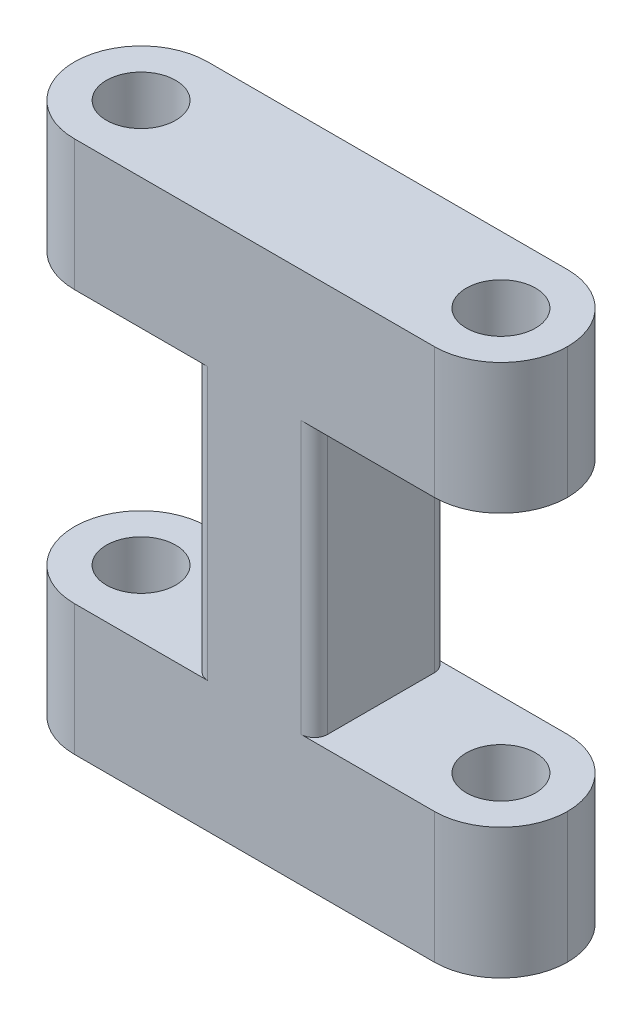
ISO-10303-21;
HEADER;
FILE_DESCRIPTION(('STEP AP214'),'2;1');
FILE_NAME('part.step','',(''),(''),'','','');
FILE_SCHEMA(('AUTOMOTIVE_DESIGN { 1 0 10303 214 1 1 1 1 }'));
ENDSEC;
DATA;
#1=APPLICATION_CONTEXT('core data for automotive mechanical design processes');
#2=APPLICATION_PROTOCOL_DEFINITION('international standard','automotive_design',2000,#1);
#3=PRODUCT_CONTEXT('',#1,'mechanical');
#4=PRODUCT('Part','Part','',(#3));
#5=PRODUCT_RELATED_PRODUCT_CATEGORY('part','',(#4));
#6=PRODUCT_DEFINITION_FORMATION('','',#4);
#7=PRODUCT_DEFINITION_CONTEXT('part definition',#1,'design');
#8=PRODUCT_DEFINITION('design','',#6,#7);
#9=PRODUCT_DEFINITION_SHAPE('','',#8);
#10=(LENGTH_UNIT() NAMED_UNIT(*) SI_UNIT(.MILLI.,.METRE.));
#11=(NAMED_UNIT(*) PLANE_ANGLE_UNIT() SI_UNIT($,.RADIAN.));
#12=(NAMED_UNIT(*) SI_UNIT($,.STERADIAN.) SOLID_ANGLE_UNIT());
#13=UNCERTAINTY_MEASURE_WITH_UNIT(LENGTH_MEASURE(1.E-05),#10,'distance_accuracy_value','');
#14=(GEOMETRIC_REPRESENTATION_CONTEXT(3) GLOBAL_UNCERTAINTY_ASSIGNED_CONTEXT((#13)) GLOBAL_UNIT_ASSIGNED_CONTEXT((#10,
#11,#12)) REPRESENTATION_CONTEXT('',''));
#15=CARTESIAN_POINT('',(0.,0.,0.));
#16=DIRECTION('',(0.,0.,1.));
#17=DIRECTION('',(1.,0.,0.));
#18=AXIS2_PLACEMENT_3D('',#15,#16,#17);
#19=CARTESIAN_POINT('',(0.,-10.2,10.));
#20=DIRECTION('',(0.,-1.,0.));
#21=DIRECTION('',(1.,0.,0.));
#22=AXIS2_PLACEMENT_3D('',#19,#20,#21);
#23=PLANE('',#22);
#24=CARTESIAN_POINT('',(13.5,-10.2,5.));
#25=DIRECTION('',(0.,-1.,0.));
#26=DIRECTION('',(1.,0.,0.));
#27=AXIS2_PLACEMENT_3D('',#24,#25,#26);
#28=CIRCLE('',#27,2.6);
#29=CARTESIAN_POINT('',(16.1,-10.2,5.));
#30=VERTEX_POINT('',#29);
#31=EDGE_CURVE('E366',#30,#30,#28,.T.);
#32=ORIENTED_EDGE('',*,*,#31,.T.);
#33=EDGE_LOOP('',(#32));
#34=FACE_BOUND('',#33,.T.);
#35=CARTESIAN_POINT('',(13.5,-10.2,5.));
#36=DIRECTION('',(0.,-1.,0.));
#37=DIRECTION('',(1.,0.,0.));
#38=AXIS2_PLACEMENT_3D('',#35,#36,#37);
#39=CIRCLE('',#38,5.);
#40=CARTESIAN_POINT('',(13.5,-10.2,10.));
#41=VERTEX_POINT('',#40);
#42=CARTESIAN_POINT('',(18.5,-10.2,5.));
#43=VERTEX_POINT('',#42);
#44=EDGE_CURVE('E247',#41,#43,#39,.F.);
#45=ORIENTED_EDGE('',*,*,#44,.T.);
#46=CARTESIAN_POINT('',(13.5,-10.2,5.));
#47=DIRECTION('',(0.,-1.,0.));
#48=DIRECTION('',(1.,0.,0.));
#49=AXIS2_PLACEMENT_3D('',#46,#47,#48);
#50=CIRCLE('',#49,5.);
#51=CARTESIAN_POINT('',(13.5,-10.2,0.));
#52=VERTEX_POINT('',#51);
#53=EDGE_CURVE('E249',#43,#52,#50,.F.);
#54=ORIENTED_EDGE('',*,*,#53,.T.);
#55=DIRECTION('',(-1.,0.,0.));
#56=VECTOR('',#55,1.);
#57=CARTESIAN_POINT('',(0.,-10.2,0.));
#58=LINE('',#57,#56);
#59=CARTESIAN_POINT('',(3.5,-10.2,0.));
#60=VERTEX_POINT('',#59);
#61=EDGE_CURVE('E205',#52,#60,#58,.T.);
#62=ORIENTED_EDGE('',*,*,#61,.T.);
#63=CARTESIAN_POINT('',(3.5,-10.2,0.999999999999999));
#64=DIRECTION('',(0.,-1.,0.));
#65=DIRECTION('',(1.,0.,0.));
#66=AXIS2_PLACEMENT_3D('',#63,#64,#65);
#67=CIRCLE('',#66,1.);
#68=CARTESIAN_POINT('',(4.5,-10.2,0.999999999999999));
#69=VERTEX_POINT('',#68);
#70=EDGE_CURVE('E301',#60,#69,#67,.T.);
#71=ORIENTED_EDGE('',*,*,#70,.T.);
#72=DIRECTION('',(0.,0.,-1.));
#73=VECTOR('',#72,1.);
#74=CARTESIAN_POINT('',(4.5,-10.2,10.));
#75=LINE('',#74,#73);
#76=CARTESIAN_POINT('',(4.5,-10.2,9.));
#77=VERTEX_POINT('',#76);
#78=EDGE_CURVE('E223',#77,#69,#75,.T.);
#79=ORIENTED_EDGE('',*,*,#78,.F.);
#80=CARTESIAN_POINT('',(3.5,-10.2,9.));
#81=DIRECTION('',(0.,-1.,0.));
#82=DIRECTION('',(1.,0.,0.));
#83=AXIS2_PLACEMENT_3D('',#80,#81,#82);
#84=CIRCLE('',#83,1.);
#85=CARTESIAN_POINT('',(3.5,-10.2,10.));
#86=VERTEX_POINT('',#85);
#87=EDGE_CURVE('E305',#77,#86,#84,.T.);
#88=ORIENTED_EDGE('',*,*,#87,.T.);
#89=DIRECTION('',(-1.,0.,0.));
#90=VECTOR('',#89,1.);
#91=CARTESIAN_POINT('',(0.,-10.2,10.));
#92=LINE('',#91,#90);
#93=EDGE_CURVE('E213',#41,#86,#92,.T.);
#94=ORIENTED_EDGE('',*,*,#93,.F.);
#95=EDGE_LOOP('',(#45,#54,#62,#71,#79,#88,#94));
#96=FACE_BOUND('',#95,.T.);
#97=ADVANCED_FACE('F35',(#34,#96),#23,.F.);
#98=CARTESIAN_POINT('',(4.5,0.,10.));
#99=DIRECTION('',(-1.,0.,0.));
#100=DIRECTION('',(0.,0.,1.));
#101=AXIS2_PLACEMENT_3D('',#98,#99,#100);
#102=PLANE('',#101);
#103=ORIENTED_EDGE('',*,*,#78,.T.);
#104=DIRECTION('',(0.,1.,0.));
#105=VECTOR('',#104,1.);
#106=CARTESIAN_POINT('',(4.5,0.,0.999999999999999));
#107=LINE('',#106,#105);
#108=CARTESIAN_POINT('',(4.5,10.2,0.999999999999999));
#109=VERTEX_POINT('',#108);
#110=EDGE_CURVE('E280',#69,#109,#107,.T.);
#111=ORIENTED_EDGE('',*,*,#110,.T.);
#112=DIRECTION('',(0.,0.,-1.));
#113=VECTOR('',#112,1.);
#114=CARTESIAN_POINT('',(4.5,10.2,10.));
#115=LINE('',#114,#113);
#116=CARTESIAN_POINT('',(4.5,10.2,9.));
#117=VERTEX_POINT('',#116);
#118=EDGE_CURVE('E220',#117,#109,#115,.T.);
#119=ORIENTED_EDGE('',*,*,#118,.F.);
#120=DIRECTION('',(0.,1.,0.));
#121=VECTOR('',#120,1.);
#122=CARTESIAN_POINT('',(4.5,-10.2,9.));
#123=LINE('',#122,#121);
#124=EDGE_CURVE('E267',#117,#77,#123,.F.);
#125=ORIENTED_EDGE('',*,*,#124,.T.);
#126=EDGE_LOOP('',(#103,#111,#119,#125));
#127=FACE_BOUND('',#126,.T.);
#128=ADVANCED_FACE('F345',(#127),#102,.F.);
#129=CARTESIAN_POINT('',(0.,10.2,10.));
#130=DIRECTION('',(0.,-1.,0.));
#131=DIRECTION('',(1.,0.,0.));
#132=AXIS2_PLACEMENT_3D('',#129,#130,#131);
#133=PLANE('',#132);
#134=CARTESIAN_POINT('',(13.5,10.2,5.));
#135=DIRECTION('',(0.,-1.,0.));
#136=DIRECTION('',(1.,0.,0.));
#137=AXIS2_PLACEMENT_3D('',#134,#135,#136);
#138=CIRCLE('',#137,2.6);
#139=CARTESIAN_POINT('',(16.1,10.2,5.));
#140=VERTEX_POINT('',#139);
#141=EDGE_CURVE('E369',#140,#140,#138,.T.);
#142=ORIENTED_EDGE('',*,*,#141,.F.);
#143=EDGE_LOOP('',(#142));
#144=FACE_BOUND('',#143,.T.);
#145=DIRECTION('',(-1.,0.,0.));
#146=VECTOR('',#145,1.);
#147=CARTESIAN_POINT('',(0.,10.2,0.));
#148=LINE('',#147,#146);
#149=CARTESIAN_POINT('',(13.5,10.2,0.));
#150=VERTEX_POINT('',#149);
#151=CARTESIAN_POINT('',(3.5,10.2,0.));
#152=VERTEX_POINT('',#151);
#153=EDGE_CURVE('E201',#150,#152,#148,.T.);
#154=ORIENTED_EDGE('',*,*,#153,.F.);
#155=CARTESIAN_POINT('',(13.5,10.2,5.));
#156=DIRECTION('',(0.,-1.,0.));
#157=DIRECTION('',(1.,0.,0.));
#158=AXIS2_PLACEMENT_3D('',#155,#156,#157);
#159=CIRCLE('',#158,5.);
#160=CARTESIAN_POINT('',(18.5,10.2,5.));
#161=VERTEX_POINT('',#160);
#162=EDGE_CURVE('E237',#150,#161,#159,.T.);
#163=ORIENTED_EDGE('',*,*,#162,.T.);
#164=CARTESIAN_POINT('',(13.5,10.2,5.));
#165=DIRECTION('',(0.,-1.,0.));
#166=DIRECTION('',(1.,0.,0.));
#167=AXIS2_PLACEMENT_3D('',#164,#165,#166);
#168=CIRCLE('',#167,5.);
#169=CARTESIAN_POINT('',(13.5,10.2,10.));
#170=VERTEX_POINT('',#169);
#171=EDGE_CURVE('E235',#161,#170,#168,.T.);
#172=ORIENTED_EDGE('',*,*,#171,.T.);
#173=DIRECTION('',(-1.,0.,0.));
#174=VECTOR('',#173,1.);
#175=CARTESIAN_POINT('',(0.,10.2,10.));
#176=LINE('',#175,#174);
#177=CARTESIAN_POINT('',(3.5,10.2,10.));
#178=VERTEX_POINT('',#177);
#179=EDGE_CURVE('E327',#170,#178,#176,.T.);
#180=ORIENTED_EDGE('',*,*,#179,.T.);
#181=CARTESIAN_POINT('',(3.5,10.2,9.));
#182=DIRECTION('',(0.,-1.,0.));
#183=DIRECTION('',(1.,0.,0.));
#184=AXIS2_PLACEMENT_3D('',#181,#182,#183);
#185=CIRCLE('',#184,1.);
#186=EDGE_CURVE('E303',#178,#117,#185,.F.);
#187=ORIENTED_EDGE('',*,*,#186,.T.);
#188=ORIENTED_EDGE('',*,*,#118,.T.);
#189=CARTESIAN_POINT('',(3.5,10.2,0.999999999999999));
#190=DIRECTION('',(0.,-1.,0.));
#191=DIRECTION('',(1.,0.,0.));
#192=AXIS2_PLACEMENT_3D('',#189,#190,#191);
#193=CIRCLE('',#192,1.);
#194=EDGE_CURVE('E298',#109,#152,#193,.F.);
#195=ORIENTED_EDGE('',*,*,#194,.T.);
#196=EDGE_LOOP('',(#154,#163,#172,#180,#187,#188,#195));
#197=FACE_BOUND('',#196,.T.);
#198=ADVANCED_FACE('F348',(#144,#197),#133,.T.);
#199=CARTESIAN_POINT('',(0.,20.,10.));
#200=DIRECTION('',(0.,1.,0.));
#201=DIRECTION('',(-1.,0.,0.));
#202=AXIS2_PLACEMENT_3D('',#199,#200,#201);
#203=PLANE('',#202);
#204=CARTESIAN_POINT('',(-13.5,20.,5.));
#205=DIRECTION('',(0.,-1.,0.));
#206=DIRECTION('',(0.,0.,-1.));
#207=AXIS2_PLACEMENT_3D('',#204,#205,#206);
#208=CIRCLE('',#207,2.6);
#209=CARTESIAN_POINT('',(-13.5,20.,2.4));
#210=VERTEX_POINT('',#209);
#211=EDGE_CURVE('E372',#210,#210,#208,.T.);
#212=ORIENTED_EDGE('',*,*,#211,.T.);
#213=EDGE_LOOP('',(#212));
#214=FACE_BOUND('',#213,.T.);
#215=CARTESIAN_POINT('',(13.5,20.,5.));
#216=DIRECTION('',(0.,-1.,0.));
#217=DIRECTION('',(0.,0.,-1.));
#218=AXIS2_PLACEMENT_3D('',#215,#216,#217);
#219=CIRCLE('',#218,2.6);
#220=CARTESIAN_POINT('',(13.5,20.,2.4));
#221=VERTEX_POINT('',#220);
#222=EDGE_CURVE('E376',#221,#221,#219,.T.);
#223=ORIENTED_EDGE('',*,*,#222,.T.);
#224=EDGE_LOOP('',(#223));
#225=FACE_BOUND('',#224,.T.);
#226=CARTESIAN_POINT('',(13.5,20.,5.));
#227=DIRECTION('',(0.,1.,0.));
#228=DIRECTION('',(-1.,0.,0.));
#229=AXIS2_PLACEMENT_3D('',#226,#227,#228);
#230=CIRCLE('',#229,5.);
#231=CARTESIAN_POINT('',(13.5,20.,10.));
#232=VERTEX_POINT('',#231);
#233=CARTESIAN_POINT('',(18.5,20.,5.));
#234=VERTEX_POINT('',#233);
#235=EDGE_CURVE('E183',#232,#234,#230,.T.);
#236=ORIENTED_EDGE('',*,*,#235,.T.);
#237=CARTESIAN_POINT('',(13.5,20.,5.));
#238=DIRECTION('',(0.,1.,0.));
#239=DIRECTION('',(-1.,0.,0.));
#240=AXIS2_PLACEMENT_3D('',#237,#238,#239);
#241=CIRCLE('',#240,5.);
#242=CARTESIAN_POINT('',(13.5,20.,0.));
#243=VERTEX_POINT('',#242);
#244=EDGE_CURVE('E200',#234,#243,#241,.T.);
#245=ORIENTED_EDGE('',*,*,#244,.T.);
#246=DIRECTION('',(1.,0.,0.));
#247=VECTOR('',#246,1.);
#248=CARTESIAN_POINT('',(0.,20.,0.));
#249=LINE('',#248,#247);
#250=CARTESIAN_POINT('',(-13.5,20.,0.));
#251=VERTEX_POINT('',#250);
#252=EDGE_CURVE('E191',#251,#243,#249,.T.);
#253=ORIENTED_EDGE('',*,*,#252,.F.);
#254=CARTESIAN_POINT('',(-13.5,20.,5.));
#255=DIRECTION('',(0.,1.,0.));
#256=DIRECTION('',(-1.,0.,0.));
#257=AXIS2_PLACEMENT_3D('',#254,#255,#256);
#258=CIRCLE('',#257,5.);
#259=CARTESIAN_POINT('',(-18.5,20.,5.));
#260=VERTEX_POINT('',#259);
#261=EDGE_CURVE('E173',#251,#260,#258,.T.);
#262=ORIENTED_EDGE('',*,*,#261,.T.);
#263=CARTESIAN_POINT('',(-13.5,20.,5.));
#264=DIRECTION('',(0.,1.,0.));
#265=DIRECTION('',(-1.,0.,0.));
#266=AXIS2_PLACEMENT_3D('',#263,#264,#265);
#267=CIRCLE('',#266,5.);
#268=CARTESIAN_POINT('',(-13.5,20.,10.));
#269=VERTEX_POINT('',#268);
#270=EDGE_CURVE('E184',#260,#269,#267,.T.);
#271=ORIENTED_EDGE('',*,*,#270,.T.);
#272=DIRECTION('',(1.,0.,0.));
#273=VECTOR('',#272,1.);
#274=CARTESIAN_POINT('',(0.,20.,10.));
#275=LINE('',#274,#273);
#276=EDGE_CURVE('E323',#269,#232,#275,.T.);
#277=ORIENTED_EDGE('',*,*,#276,.T.);
#278=EDGE_LOOP('',(#236,#245,#253,#262,#271,#277));
#279=FACE_BOUND('',#278,.T.);
#280=ADVANCED_FACE('F198',(#214,#225,#279),#203,.T.);
#281=CARTESIAN_POINT('',(0.,10.2,10.));
#282=DIRECTION('',(0.,1.,0.));
#283=DIRECTION('',(0.,0.,1.));
#284=AXIS2_PLACEMENT_3D('',#281,#282,#283);
#285=PLANE('',#284);
#286=CARTESIAN_POINT('',(-13.5,10.2,5.));
#287=DIRECTION('',(0.,1.,0.));
#288=DIRECTION('',(0.,0.,1.));
#289=AXIS2_PLACEMENT_3D('',#286,#287,#288);
#290=CIRCLE('',#289,2.6);
#291=CARTESIAN_POINT('',(-13.5,10.2,7.6));
#292=VERTEX_POINT('',#291);
#293=EDGE_CURVE('E278',#292,#292,#290,.T.);
#294=ORIENTED_EDGE('',*,*,#293,.T.);
#295=EDGE_LOOP('',(#294));
#296=FACE_BOUND('',#295,.T.);
#297=CARTESIAN_POINT('',(-13.5,10.2,5.));
#298=DIRECTION('',(0.,1.,0.));
#299=DIRECTION('',(0.,0.,1.));
#300=AXIS2_PLACEMENT_3D('',#297,#298,#299);
#301=CIRCLE('',#300,5.);
#302=CARTESIAN_POINT('',(-13.5,10.2,10.));
#303=VERTEX_POINT('',#302);
#304=CARTESIAN_POINT('',(-18.5,10.2,5.));
#305=VERTEX_POINT('',#304);
#306=EDGE_CURVE('E259',#303,#305,#301,.F.);
#307=ORIENTED_EDGE('',*,*,#306,.T.);
#308=CARTESIAN_POINT('',(-13.5,10.2,5.));
#309=DIRECTION('',(0.,1.,0.));
#310=DIRECTION('',(0.,0.,1.));
#311=AXIS2_PLACEMENT_3D('',#308,#309,#310);
#312=CIRCLE('',#311,5.);
#313=CARTESIAN_POINT('',(-13.5,10.2,0.));
#314=VERTEX_POINT('',#313);
#315=EDGE_CURVE('E261',#305,#314,#312,.F.);
#316=ORIENTED_EDGE('',*,*,#315,.T.);
#317=DIRECTION('',(1.,0.,0.));
#318=VECTOR('',#317,1.);
#319=CARTESIAN_POINT('',(0.,10.2,0.));
#320=LINE('',#319,#318);
#321=CARTESIAN_POINT('',(-3.5,10.2,0.));
#322=VERTEX_POINT('',#321);
#323=EDGE_CURVE('E194',#314,#322,#320,.T.);
#324=ORIENTED_EDGE('',*,*,#323,.T.);
#325=CARTESIAN_POINT('',(-3.5,10.2,1.));
#326=DIRECTION('',(0.,1.,0.));
#327=DIRECTION('',(0.,0.,1.));
#328=AXIS2_PLACEMENT_3D('',#325,#326,#327);
#329=CIRCLE('',#328,1.);
#330=CARTESIAN_POINT('',(-4.5,10.2,0.999999999999999));
#331=VERTEX_POINT('',#330);
#332=EDGE_CURVE('E50',#322,#331,#329,.T.);
#333=ORIENTED_EDGE('',*,*,#332,.T.);
#334=DIRECTION('',(0.,0.,-1.));
#335=VECTOR('',#334,1.);
#336=CARTESIAN_POINT('',(-4.5,10.2,10.));
#337=LINE('',#336,#335);
#338=CARTESIAN_POINT('',(-4.5,10.2,9.));
#339=VERTEX_POINT('',#338);
#340=EDGE_CURVE('E217',#339,#331,#337,.T.);
#341=ORIENTED_EDGE('',*,*,#340,.F.);
#342=CARTESIAN_POINT('',(-3.5,10.2,9.));
#343=DIRECTION('',(0.,1.,0.));
#344=DIRECTION('',(0.,0.,1.));
#345=AXIS2_PLACEMENT_3D('',#342,#343,#344);
#346=CIRCLE('',#345,1.);
#347=CARTESIAN_POINT('',(-3.5,10.2,10.));
#348=VERTEX_POINT('',#347);
#349=EDGE_CURVE('E43',#339,#348,#346,.T.);
#350=ORIENTED_EDGE('',*,*,#349,.T.);
#351=DIRECTION('',(1.,0.,0.));
#352=VECTOR('',#351,1.);
#353=CARTESIAN_POINT('',(0.,10.2,10.));
#354=LINE('',#353,#352);
#355=EDGE_CURVE('E313',#303,#348,#354,.T.);
#356=ORIENTED_EDGE('',*,*,#355,.F.);
#357=EDGE_LOOP('',(#307,#316,#324,#333,#341,#350,#356));
#358=FACE_BOUND('',#357,.T.);
#359=ADVANCED_FACE('F312',(#296,#358),#285,.F.);
#360=CARTESIAN_POINT('',(-4.5,0.,10.));
#361=DIRECTION('',(-1.,0.,0.));
#362=DIRECTION('',(0.,0.,1.));
#363=AXIS2_PLACEMENT_3D('',#360,#361,#362);
#364=PLANE('',#363);
#365=ORIENTED_EDGE('',*,*,#340,.T.);
#366=DIRECTION('',(0.,1.,0.));
#367=VECTOR('',#366,1.);
#368=CARTESIAN_POINT('',(-4.5,-10.2,1.));
#369=LINE('',#368,#367);
#370=CARTESIAN_POINT('',(-4.5,-10.2,0.999999999999999));
#371=VERTEX_POINT('',#370);
#372=EDGE_CURVE('E296',#331,#371,#369,.F.);
#373=ORIENTED_EDGE('',*,*,#372,.T.);
#374=DIRECTION('',(0.,0.,-1.));
#375=VECTOR('',#374,1.);
#376=CARTESIAN_POINT('',(-4.5,-10.2,10.));
#377=LINE('',#376,#375);
#378=CARTESIAN_POINT('',(-4.5,-10.2,9.));
#379=VERTEX_POINT('',#378);
#380=EDGE_CURVE('E214',#379,#371,#377,.T.);
#381=ORIENTED_EDGE('',*,*,#380,.F.);
#382=DIRECTION('',(0.,1.,0.));
#383=VECTOR('',#382,1.);
#384=CARTESIAN_POINT('',(-4.5,0.,9.));
#385=LINE('',#384,#383);
#386=EDGE_CURVE('E294',#379,#339,#385,.T.);
#387=ORIENTED_EDGE('',*,*,#386,.T.);
#388=EDGE_LOOP('',(#365,#373,#381,#387));
#389=FACE_BOUND('',#388,.T.);
#390=ADVANCED_FACE('F396',(#389),#364,.T.);
#391=CARTESIAN_POINT('',(0.,-10.2,10.));
#392=DIRECTION('',(0.,1.,0.));
#393=DIRECTION('',(0.,0.,1.));
#394=AXIS2_PLACEMENT_3D('',#391,#392,#393);
#395=PLANE('',#394);
#396=CARTESIAN_POINT('',(-13.5,-10.2,5.));
#397=DIRECTION('',(0.,1.,0.));
#398=DIRECTION('',(0.,0.,1.));
#399=AXIS2_PLACEMENT_3D('',#396,#397,#398);
#400=CIRCLE('',#399,2.6);
#401=CARTESIAN_POINT('',(-13.5,-10.2,7.6));
#402=VERTEX_POINT('',#401);
#403=EDGE_CURVE('E363',#402,#402,#400,.T.);
#404=ORIENTED_EDGE('',*,*,#403,.F.);
#405=EDGE_LOOP('',(#404));
#406=FACE_BOUND('',#405,.T.);
#407=DIRECTION('',(1.,0.,0.));
#408=VECTOR('',#407,1.);
#409=CARTESIAN_POINT('',(0.,-10.2,0.));
#410=LINE('',#409,#408);
#411=CARTESIAN_POINT('',(-13.5,-10.2,0.));
#412=VERTEX_POINT('',#411);
#413=CARTESIAN_POINT('',(-3.5,-10.2,0.));
#414=VERTEX_POINT('',#413);
#415=EDGE_CURVE('E203',#412,#414,#410,.T.);
#416=ORIENTED_EDGE('',*,*,#415,.F.);
#417=CARTESIAN_POINT('',(-13.5,-10.2,5.));
#418=DIRECTION('',(0.,1.,0.));
#419=DIRECTION('',(0.,0.,1.));
#420=AXIS2_PLACEMENT_3D('',#417,#418,#419);
#421=CIRCLE('',#420,5.);
#422=CARTESIAN_POINT('',(-18.5,-10.2,5.));
#423=VERTEX_POINT('',#422);
#424=EDGE_CURVE('E265',#412,#423,#421,.T.);
#425=ORIENTED_EDGE('',*,*,#424,.T.);
#426=CARTESIAN_POINT('',(-13.5,-10.2,5.));
#427=DIRECTION('',(0.,1.,0.));
#428=DIRECTION('',(0.,0.,1.));
#429=AXIS2_PLACEMENT_3D('',#426,#427,#428);
#430=CIRCLE('',#429,5.);
#431=CARTESIAN_POINT('',(-13.5,-10.2,10.));
#432=VERTEX_POINT('',#431);
#433=EDGE_CURVE('E263',#423,#432,#430,.T.);
#434=ORIENTED_EDGE('',*,*,#433,.T.);
#435=DIRECTION('',(1.,0.,0.));
#436=VECTOR('',#435,1.);
#437=CARTESIAN_POINT('',(0.,-10.2,10.));
#438=LINE('',#437,#436);
#439=CARTESIAN_POINT('',(-3.5,-10.2,10.));
#440=VERTEX_POINT('',#439);
#441=EDGE_CURVE('E319',#432,#440,#438,.T.);
#442=ORIENTED_EDGE('',*,*,#441,.T.);
#443=CARTESIAN_POINT('',(-3.5,-10.2,9.));
#444=DIRECTION('',(0.,1.,0.));
#445=DIRECTION('',(0.,0.,1.));
#446=AXIS2_PLACEMENT_3D('',#443,#444,#445);
#447=CIRCLE('',#446,1.);
#448=EDGE_CURVE('E11',#440,#379,#447,.F.);
#449=ORIENTED_EDGE('',*,*,#448,.T.);
#450=ORIENTED_EDGE('',*,*,#380,.T.);
#451=CARTESIAN_POINT('',(-3.5,-10.2,1.));
#452=DIRECTION('',(0.,1.,0.));
#453=DIRECTION('',(0.,0.,1.));
#454=AXIS2_PLACEMENT_3D('',#451,#452,#453);
#455=CIRCLE('',#454,1.);
#456=EDGE_CURVE('E309',#371,#414,#455,.F.);
#457=ORIENTED_EDGE('',*,*,#456,.T.);
#458=EDGE_LOOP('',(#416,#425,#434,#442,#449,#450,#457));
#459=FACE_BOUND('',#458,.T.);
#460=ADVANCED_FACE('F402',(#406,#459),#395,.T.);
#461=CARTESIAN_POINT('',(0.,-20.,10.));
#462=DIRECTION('',(0.,1.,0.));
#463=DIRECTION('',(-1.,0.,0.));
#464=AXIS2_PLACEMENT_3D('',#461,#462,#463);
#465=PLANE('',#464);
#466=CARTESIAN_POINT('',(-13.5,-20.,5.));
#467=DIRECTION('',(0.,-1.,0.));
#468=DIRECTION('',(0.,0.,-1.));
#469=AXIS2_PLACEMENT_3D('',#466,#467,#468);
#470=CIRCLE('',#469,2.6);
#471=CARTESIAN_POINT('',(-13.5,-20.,2.4));
#472=VERTEX_POINT('',#471);
#473=EDGE_CURVE('E379',#472,#472,#470,.T.);
#474=ORIENTED_EDGE('',*,*,#473,.F.);
#475=EDGE_LOOP('',(#474));
#476=FACE_BOUND('',#475,.T.);
#477=CARTESIAN_POINT('',(13.5,-20.,5.));
#478=DIRECTION('',(0.,-1.,0.));
#479=DIRECTION('',(0.,0.,-1.));
#480=AXIS2_PLACEMENT_3D('',#477,#478,#479);
#481=CIRCLE('',#480,2.6);
#482=CARTESIAN_POINT('',(13.5,-20.,2.4));
#483=VERTEX_POINT('',#482);
#484=EDGE_CURVE('E373',#483,#483,#481,.T.);
#485=ORIENTED_EDGE('',*,*,#484,.F.);
#486=EDGE_LOOP('',(#485));
#487=FACE_BOUND('',#486,.T.);
#488=DIRECTION('',(1.,0.,0.));
#489=VECTOR('',#488,1.);
#490=CARTESIAN_POINT('',(0.,-20.,0.));
#491=LINE('',#490,#489);
#492=CARTESIAN_POINT('',(-13.5,-20.,0.));
#493=VERTEX_POINT('',#492);
#494=CARTESIAN_POINT('',(13.5,-20.,0.));
#495=VERTEX_POINT('',#494);
#496=EDGE_CURVE('E210',#493,#495,#491,.T.);
#497=ORIENTED_EDGE('',*,*,#496,.T.);
#498=CARTESIAN_POINT('',(13.5,-20.,5.));
#499=DIRECTION('',(0.,1.,0.));
#500=DIRECTION('',(-1.,0.,0.));
#501=AXIS2_PLACEMENT_3D('',#498,#499,#500);
#502=CIRCLE('',#501,5.);
#503=CARTESIAN_POINT('',(18.5,-20.,5.));
#504=VERTEX_POINT('',#503);
#505=EDGE_CURVE('E257',#495,#504,#502,.F.);
#506=ORIENTED_EDGE('',*,*,#505,.T.);
#507=CARTESIAN_POINT('',(13.5,-20.,5.));
#508=DIRECTION('',(0.,1.,0.));
#509=DIRECTION('',(-1.,0.,0.));
#510=AXIS2_PLACEMENT_3D('',#507,#508,#509);
#511=CIRCLE('',#510,5.);
#512=CARTESIAN_POINT('',(13.5,-20.,10.));
#513=VERTEX_POINT('',#512);
#514=EDGE_CURVE('E255',#504,#513,#511,.F.);
#515=ORIENTED_EDGE('',*,*,#514,.T.);
#516=DIRECTION('',(1.,0.,0.));
#517=VECTOR('',#516,1.);
#518=CARTESIAN_POINT('',(0.,-20.,10.));
#519=LINE('',#518,#517);
#520=CARTESIAN_POINT('',(-13.5,-20.,10.));
#521=VERTEX_POINT('',#520);
#522=EDGE_CURVE('E218',#521,#513,#519,.T.);
#523=ORIENTED_EDGE('',*,*,#522,.F.);
#524=CARTESIAN_POINT('',(-13.5,-20.,5.));
#525=DIRECTION('',(0.,1.,0.));
#526=DIRECTION('',(-1.,0.,0.));
#527=AXIS2_PLACEMENT_3D('',#524,#525,#526);
#528=CIRCLE('',#527,5.);
#529=CARTESIAN_POINT('',(-18.5,-20.,5.));
#530=VERTEX_POINT('',#529);
#531=EDGE_CURVE('E251',#521,#530,#528,.F.);
#532=ORIENTED_EDGE('',*,*,#531,.T.);
#533=CARTESIAN_POINT('',(-13.5,-20.,5.));
#534=DIRECTION('',(0.,1.,0.));
#535=DIRECTION('',(-1.,0.,0.));
#536=AXIS2_PLACEMENT_3D('',#533,#534,#535);
#537=CIRCLE('',#536,5.);
#538=EDGE_CURVE('E253',#530,#493,#537,.F.);
#539=ORIENTED_EDGE('',*,*,#538,.T.);
#540=EDGE_LOOP('',(#497,#506,#515,#523,#532,#539));
#541=FACE_BOUND('',#540,.T.);
#542=ADVANCED_FACE('F468',(#476,#487,#541),#465,.F.);
#543=CARTESIAN_POINT('',(0.,0.,10.));
#544=DIRECTION('',(0.,0.,1.));
#545=DIRECTION('',(1.,0.,0.));
#546=AXIS2_PLACEMENT_3D('',#543,#544,#545);
#547=PLANE('',#546);
#548=DIRECTION('',(0.,1.,0.));
#549=VECTOR('',#548,1.);
#550=CARTESIAN_POINT('',(3.5,10.2,10.));
#551=LINE('',#550,#549);
#552=EDGE_CURVE('E291',#86,#178,#551,.T.);
#553=ORIENTED_EDGE('',*,*,#552,.T.);
#554=ORIENTED_EDGE('',*,*,#179,.F.);
#555=DIRECTION('',(0.,1.,0.));
#556=VECTOR('',#555,1.);
#557=CARTESIAN_POINT('',(13.5,20.,10.));
#558=LINE('',#557,#556);
#559=EDGE_CURVE('E245',#170,#232,#558,.T.);
#560=ORIENTED_EDGE('',*,*,#559,.T.);
#561=ORIENTED_EDGE('',*,*,#276,.F.);
#562=DIRECTION('',(0.,1.,0.));
#563=VECTOR('',#562,1.);
#564=CARTESIAN_POINT('',(-13.5,0.,10.));
#565=LINE('',#564,#563);
#566=EDGE_CURVE('E239',#269,#303,#565,.F.);
#567=ORIENTED_EDGE('',*,*,#566,.T.);
#568=ORIENTED_EDGE('',*,*,#355,.T.);
#569=DIRECTION('',(0.,1.,0.));
#570=VECTOR('',#569,1.);
#571=CARTESIAN_POINT('',(-3.5,0.,10.));
#572=LINE('',#571,#570);
#573=EDGE_CURVE('E288',#348,#440,#572,.F.);
#574=ORIENTED_EDGE('',*,*,#573,.T.);
#575=ORIENTED_EDGE('',*,*,#441,.F.);
#576=DIRECTION('',(0.,1.,0.));
#577=VECTOR('',#576,1.);
#578=CARTESIAN_POINT('',(-13.5,0.,10.));
#579=LINE('',#578,#577);
#580=EDGE_CURVE('E241',#432,#521,#579,.F.);
#581=ORIENTED_EDGE('',*,*,#580,.T.);
#582=ORIENTED_EDGE('',*,*,#522,.T.);
#583=DIRECTION('',(0.,1.,0.));
#584=VECTOR('',#583,1.);
#585=CARTESIAN_POINT('',(13.5,-10.2,10.));
#586=LINE('',#585,#584);
#587=EDGE_CURVE('E243',#513,#41,#586,.T.);
#588=ORIENTED_EDGE('',*,*,#587,.T.);
#589=ORIENTED_EDGE('',*,*,#93,.T.);
#590=EDGE_LOOP('',(#553,#554,#560,#561,#567,#568,#574,#575,#581,#582,#588,#589));
#591=FACE_BOUND('',#590,.T.);
#592=ADVANCED_FACE('F318',(#591),#547,.T.);
#593=CARTESIAN_POINT('',(0.,0.,0.));
#594=DIRECTION('',(0.,0.,1.));
#595=DIRECTION('',(1.,0.,0.));
#596=AXIS2_PLACEMENT_3D('',#593,#594,#595);
#597=PLANE('',#596);
#598=ORIENTED_EDGE('',*,*,#153,.T.);
#599=DIRECTION('',(0.,1.,0.));
#600=VECTOR('',#599,1.);
#601=CARTESIAN_POINT('',(3.5,0.,0.));
#602=LINE('',#601,#600);
#603=EDGE_CURVE('E285',#152,#60,#602,.F.);
#604=ORIENTED_EDGE('',*,*,#603,.T.);
#605=ORIENTED_EDGE('',*,*,#61,.F.);
#606=DIRECTION('',(0.,1.,0.));
#607=VECTOR('',#606,1.);
#608=CARTESIAN_POINT('',(13.5,0.,0.));
#609=LINE('',#608,#607);
#610=EDGE_CURVE('E195',#52,#495,#609,.F.);
#611=ORIENTED_EDGE('',*,*,#610,.T.);
#612=ORIENTED_EDGE('',*,*,#496,.F.);
#613=DIRECTION('',(0.,1.,0.));
#614=VECTOR('',#613,1.);
#615=CARTESIAN_POINT('',(-13.5,-10.2,0.));
#616=LINE('',#615,#614);
#617=EDGE_CURVE('E196',#493,#412,#616,.T.);
#618=ORIENTED_EDGE('',*,*,#617,.T.);
#619=ORIENTED_EDGE('',*,*,#415,.T.);
#620=DIRECTION('',(0.,1.,0.));
#621=VECTOR('',#620,1.);
#622=CARTESIAN_POINT('',(-3.5,10.2,0.));
#623=LINE('',#622,#621);
#624=EDGE_CURVE('E283',#414,#322,#623,.T.);
#625=ORIENTED_EDGE('',*,*,#624,.T.);
#626=ORIENTED_EDGE('',*,*,#323,.F.);
#627=DIRECTION('',(0.,1.,0.));
#628=VECTOR('',#627,1.);
#629=CARTESIAN_POINT('',(-13.5,20.,0.));
#630=LINE('',#629,#628);
#631=EDGE_CURVE('E177',#314,#251,#630,.T.);
#632=ORIENTED_EDGE('',*,*,#631,.T.);
#633=ORIENTED_EDGE('',*,*,#252,.T.);
#634=DIRECTION('',(0.,1.,0.));
#635=VECTOR('',#634,1.);
#636=CARTESIAN_POINT('',(13.5,0.,0.));
#637=LINE('',#636,#635);
#638=EDGE_CURVE('E233',#243,#150,#637,.F.);
#639=ORIENTED_EDGE('',*,*,#638,.T.);
#640=EDGE_LOOP('',(#598,#604,#605,#611,#612,#618,#619,#625,#626,#632,#633,#639));
#641=FACE_BOUND('',#640,.T.);
#642=ADVANCED_FACE('F189',(#641),#597,.F.);
#643=CARTESIAN_POINT('',(13.5,0.,5.));
#644=DIRECTION('',(0.,-1.,0.));
#645=DIRECTION('',(0.,0.,-1.));
#646=AXIS2_PLACEMENT_3D('',#643,#644,#645);
#647=CYLINDRICAL_SURFACE('',#646,5.);
#648=ORIENTED_EDGE('',*,*,#559,.F.);
#649=ORIENTED_EDGE('',*,*,#171,.F.);
#650=DIRECTION('',(0.,1.,0.));
#651=VECTOR('',#650,1.);
#652=CARTESIAN_POINT('',(18.5,10.2,5.));
#653=LINE('',#652,#651);
#654=EDGE_CURVE('E268',#234,#161,#653,.F.);
#655=ORIENTED_EDGE('',*,*,#654,.F.);
#656=ORIENTED_EDGE('',*,*,#235,.F.);
#657=EDGE_LOOP('',(#648,#649,#655,#656));
#658=FACE_BOUND('',#657,.T.);
#659=ADVANCED_FACE('F419',(#658),#647,.T.);
#660=CARTESIAN_POINT('',(13.5,0.,5.));
#661=DIRECTION('',(0.,1.,0.));
#662=DIRECTION('',(0.,0.,1.));
#663=AXIS2_PLACEMENT_3D('',#660,#661,#662);
#664=CYLINDRICAL_SURFACE('',#663,5.);
#665=ORIENTED_EDGE('',*,*,#162,.F.);
#666=ORIENTED_EDGE('',*,*,#638,.F.);
#667=ORIENTED_EDGE('',*,*,#244,.F.);
#668=ORIENTED_EDGE('',*,*,#654,.T.);
#669=EDGE_LOOP('',(#665,#666,#667,#668));
#670=FACE_BOUND('',#669,.T.);
#671=ADVANCED_FACE('F415',(#670),#664,.T.);
#672=CARTESIAN_POINT('',(13.5,0.,5.));
#673=DIRECTION('',(0.,-1.,0.));
#674=DIRECTION('',(0.,0.,-1.));
#675=AXIS2_PLACEMENT_3D('',#672,#673,#674);
#676=CYLINDRICAL_SURFACE('',#675,5.);
#677=ORIENTED_EDGE('',*,*,#587,.F.);
#678=ORIENTED_EDGE('',*,*,#514,.F.);
#679=DIRECTION('',(0.,1.,0.));
#680=VECTOR('',#679,1.);
#681=CARTESIAN_POINT('',(18.5,-20.,5.));
#682=LINE('',#681,#680);
#683=EDGE_CURVE('E271',#43,#504,#682,.F.);
#684=ORIENTED_EDGE('',*,*,#683,.F.);
#685=ORIENTED_EDGE('',*,*,#44,.F.);
#686=EDGE_LOOP('',(#677,#678,#684,#685));
#687=FACE_BOUND('',#686,.T.);
#688=ADVANCED_FACE('F418',(#687),#676,.T.);
#689=CARTESIAN_POINT('',(13.5,0.,5.));
#690=DIRECTION('',(0.,1.,0.));
#691=DIRECTION('',(0.,0.,1.));
#692=AXIS2_PLACEMENT_3D('',#689,#690,#691);
#693=CYLINDRICAL_SURFACE('',#692,5.);
#694=ORIENTED_EDGE('',*,*,#505,.F.);
#695=ORIENTED_EDGE('',*,*,#610,.F.);
#696=ORIENTED_EDGE('',*,*,#53,.F.);
#697=ORIENTED_EDGE('',*,*,#683,.T.);
#698=EDGE_LOOP('',(#694,#695,#696,#697));
#699=FACE_BOUND('',#698,.T.);
#700=ADVANCED_FACE('F424',(#699),#693,.T.);
#701=CARTESIAN_POINT('',(-13.5,0.,5.));
#702=DIRECTION('',(0.,1.,0.));
#703=DIRECTION('',(0.,0.,1.));
#704=AXIS2_PLACEMENT_3D('',#701,#702,#703);
#705=CYLINDRICAL_SURFACE('',#704,5.);
#706=DIRECTION('',(0.,1.,0.));
#707=VECTOR('',#706,1.);
#708=CARTESIAN_POINT('',(-18.5,0.,5.));
#709=LINE('',#708,#707);
#710=EDGE_CURVE('E179',#305,#260,#709,.T.);
#711=ORIENTED_EDGE('',*,*,#710,.F.);
#712=ORIENTED_EDGE('',*,*,#306,.F.);
#713=ORIENTED_EDGE('',*,*,#566,.F.);
#714=ORIENTED_EDGE('',*,*,#270,.F.);
#715=EDGE_LOOP('',(#711,#712,#713,#714));
#716=FACE_BOUND('',#715,.T.);
#717=ADVANCED_FACE('F427',(#716),#705,.T.);
#718=CARTESIAN_POINT('',(-13.5,0.,5.));
#719=DIRECTION('',(0.,-1.,0.));
#720=DIRECTION('',(0.,0.,-1.));
#721=AXIS2_PLACEMENT_3D('',#718,#719,#720);
#722=CYLINDRICAL_SURFACE('',#721,5.);
#723=ORIENTED_EDGE('',*,*,#315,.F.);
#724=ORIENTED_EDGE('',*,*,#710,.T.);
#725=ORIENTED_EDGE('',*,*,#261,.F.);
#726=ORIENTED_EDGE('',*,*,#631,.F.);
#727=EDGE_LOOP('',(#723,#724,#725,#726));
#728=FACE_BOUND('',#727,.T.);
#729=ADVANCED_FACE('F176',(#728),#722,.T.);
#730=CARTESIAN_POINT('',(-13.5,0.,5.));
#731=DIRECTION('',(0.,1.,0.));
#732=DIRECTION('',(0.,0.,1.));
#733=AXIS2_PLACEMENT_3D('',#730,#731,#732);
#734=CYLINDRICAL_SURFACE('',#733,5.);
#735=DIRECTION('',(0.,1.,0.));
#736=VECTOR('',#735,1.);
#737=CARTESIAN_POINT('',(-18.5,0.,5.));
#738=LINE('',#737,#736);
#739=EDGE_CURVE('E275',#530,#423,#738,.T.);
#740=ORIENTED_EDGE('',*,*,#739,.F.);
#741=ORIENTED_EDGE('',*,*,#531,.F.);
#742=ORIENTED_EDGE('',*,*,#580,.F.);
#743=ORIENTED_EDGE('',*,*,#433,.F.);
#744=EDGE_LOOP('',(#740,#741,#742,#743));
#745=FACE_BOUND('',#744,.T.);
#746=ADVANCED_FACE('F434',(#745),#734,.T.);
#747=CARTESIAN_POINT('',(-13.5,0.,5.));
#748=DIRECTION('',(0.,-1.,0.));
#749=DIRECTION('',(0.,0.,-1.));
#750=AXIS2_PLACEMENT_3D('',#747,#748,#749);
#751=CYLINDRICAL_SURFACE('',#750,5.);
#752=ORIENTED_EDGE('',*,*,#538,.F.);
#753=ORIENTED_EDGE('',*,*,#739,.T.);
#754=ORIENTED_EDGE('',*,*,#424,.F.);
#755=ORIENTED_EDGE('',*,*,#617,.F.);
#756=EDGE_LOOP('',(#752,#753,#754,#755));
#757=FACE_BOUND('',#756,.T.);
#758=ADVANCED_FACE('F438',(#757),#751,.T.);
#759=CARTESIAN_POINT('',(3.5,0.,0.999999999999999));
#760=DIRECTION('',(0.,1.,0.));
#761=DIRECTION('',(0.,0.,1.));
#762=AXIS2_PLACEMENT_3D('',#759,#760,#761);
#763=CYLINDRICAL_SURFACE('',#762,1.);
#764=ORIENTED_EDGE('',*,*,#70,.F.);
#765=ORIENTED_EDGE('',*,*,#603,.F.);
#766=ORIENTED_EDGE('',*,*,#194,.F.);
#767=ORIENTED_EDGE('',*,*,#110,.F.);
#768=EDGE_LOOP('',(#764,#765,#766,#767));
#769=FACE_BOUND('',#768,.T.);
#770=ADVANCED_FACE('F342',(#769),#763,.T.);
#771=CARTESIAN_POINT('',(3.5,0.,9.));
#772=DIRECTION('',(0.,-1.,0.));
#773=DIRECTION('',(0.,0.,-1.));
#774=AXIS2_PLACEMENT_3D('',#771,#772,#773);
#775=CYLINDRICAL_SURFACE('',#774,1.);
#776=ORIENTED_EDGE('',*,*,#87,.F.);
#777=ORIENTED_EDGE('',*,*,#124,.F.);
#778=ORIENTED_EDGE('',*,*,#186,.F.);
#779=ORIENTED_EDGE('',*,*,#552,.F.);
#780=EDGE_LOOP('',(#776,#777,#778,#779));
#781=FACE_BOUND('',#780,.T.);
#782=ADVANCED_FACE('F354',(#781),#775,.T.);
#783=CARTESIAN_POINT('',(-3.5,0.,1.));
#784=DIRECTION('',(0.,-1.,0.));
#785=DIRECTION('',(0.,0.,-1.));
#786=AXIS2_PLACEMENT_3D('',#783,#784,#785);
#787=CYLINDRICAL_SURFACE('',#786,1.);
#788=ORIENTED_EDGE('',*,*,#456,.F.);
#789=ORIENTED_EDGE('',*,*,#372,.F.);
#790=ORIENTED_EDGE('',*,*,#332,.F.);
#791=ORIENTED_EDGE('',*,*,#624,.F.);
#792=EDGE_LOOP('',(#788,#789,#790,#791));
#793=FACE_BOUND('',#792,.T.);
#794=ADVANCED_FACE('F448',(#793),#787,.T.);
#795=CARTESIAN_POINT('',(-3.5,0.,9.));
#796=DIRECTION('',(0.,1.,0.));
#797=DIRECTION('',(0.,0.,1.));
#798=AXIS2_PLACEMENT_3D('',#795,#796,#797);
#799=CYLINDRICAL_SURFACE('',#798,1.);
#800=ORIENTED_EDGE('',*,*,#448,.F.);
#801=ORIENTED_EDGE('',*,*,#573,.F.);
#802=ORIENTED_EDGE('',*,*,#349,.F.);
#803=ORIENTED_EDGE('',*,*,#386,.F.);
#804=EDGE_LOOP('',(#800,#801,#802,#803));
#805=FACE_BOUND('',#804,.T.);
#806=ADVANCED_FACE('F37',(#805),#799,.T.);
#807=CARTESIAN_POINT('',(13.5,20.,5.));
#808=DIRECTION('',(0.,-1.,0.));
#809=DIRECTION('',(0.,0.,-1.));
#810=AXIS2_PLACEMENT_3D('',#807,#808,#809);
#811=CYLINDRICAL_SURFACE('',#810,2.6);
#812=ORIENTED_EDGE('',*,*,#484,.T.);
#813=EDGE_LOOP('',(#812));
#814=FACE_BOUND('',#813,.T.);
#815=ORIENTED_EDGE('',*,*,#31,.F.);
#816=EDGE_LOOP('',(#815));
#817=FACE_BOUND('',#816,.T.);
#818=ADVANCED_FACE('F454',(#814,#817),#811,.F.);
#819=CARTESIAN_POINT('',(-13.5,20.,5.));
#820=DIRECTION('',(0.,-1.,0.));
#821=DIRECTION('',(0.,0.,-1.));
#822=AXIS2_PLACEMENT_3D('',#819,#820,#821);
#823=CYLINDRICAL_SURFACE('',#822,2.6);
#824=ORIENTED_EDGE('',*,*,#403,.T.);
#825=EDGE_LOOP('',(#824));
#826=FACE_BOUND('',#825,.T.);
#827=ORIENTED_EDGE('',*,*,#473,.T.);
#828=EDGE_LOOP('',(#827));
#829=FACE_BOUND('',#828,.T.);
#830=ADVANCED_FACE('F391',(#826,#829),#823,.F.);
#831=ORIENTED_EDGE('',*,*,#211,.F.);
#832=EDGE_LOOP('',(#831));
#833=FACE_BOUND('',#832,.T.);
#834=ORIENTED_EDGE('',*,*,#293,.F.);
#835=EDGE_LOOP('',(#834));
#836=FACE_BOUND('',#835,.T.);
#837=ADVANCED_FACE('F387',(#833,#836),#823,.F.);
#838=ORIENTED_EDGE('',*,*,#141,.T.);
#839=EDGE_LOOP('',(#838));
#840=FACE_BOUND('',#839,.T.);
#841=ORIENTED_EDGE('',*,*,#222,.F.);
#842=EDGE_LOOP('',(#841));
#843=FACE_BOUND('',#842,.T.);
#844=ADVANCED_FACE('F390',(#840,#843),#811,.F.);
#845=CLOSED_SHELL('',(#97,#128,#198,#280,#359,#390,#460,#542,#592,#642,#659,#671,#688,#700,#717,
#729,#746,#758,#770,#782,#794,#806,#818,#830,#837,#844));
#846=MANIFOLD_SOLID_BREP('B2',#845);
#847=ADVANCED_BREP_SHAPE_REPRESENTATION('',(#18,#846),#14);
#848=SHAPE_DEFINITION_REPRESENTATION(#9,#847);
ENDSEC;
END-ISO-10303-21;
